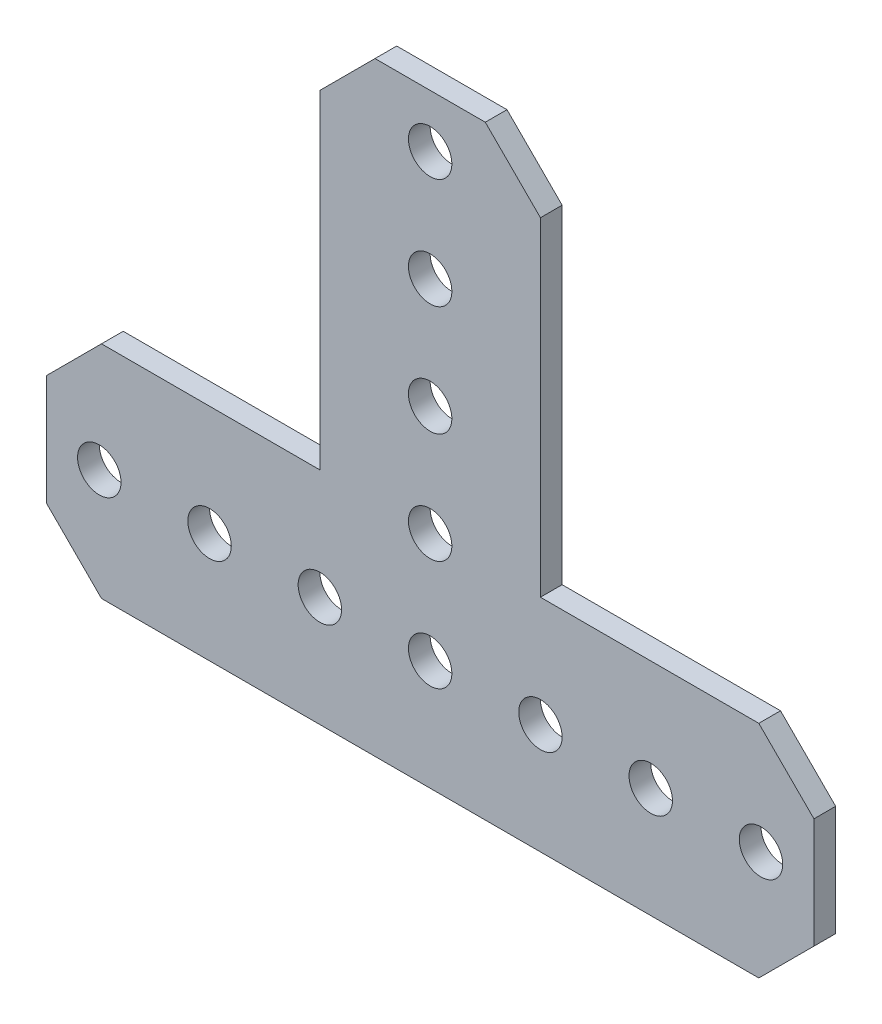
ISO-10303-21;
HEADER;
FILE_DESCRIPTION(('STEP AP214'),'2;1');
FILE_NAME('part.step','',(''),(''),'','','');
FILE_SCHEMA(('AUTOMOTIVE_DESIGN { 1 0 10303 214 1 1 1 1 }'));
ENDSEC;
DATA;
#1=APPLICATION_CONTEXT('core data for automotive mechanical design processes');
#2=APPLICATION_PROTOCOL_DEFINITION('international standard','automotive_design',2000,#1);
#3=PRODUCT_CONTEXT('',#1,'mechanical');
#4=PRODUCT('Part','Part','',(#3));
#5=PRODUCT_RELATED_PRODUCT_CATEGORY('part','',(#4));
#6=PRODUCT_DEFINITION_FORMATION('','',#4);
#7=PRODUCT_DEFINITION_CONTEXT('part definition',#1,'design');
#8=PRODUCT_DEFINITION('design','',#6,#7);
#9=PRODUCT_DEFINITION_SHAPE('','',#8);
#10=(LENGTH_UNIT() NAMED_UNIT(*) SI_UNIT(.MILLI.,.METRE.));
#11=(NAMED_UNIT(*) PLANE_ANGLE_UNIT() SI_UNIT($,.RADIAN.));
#12=(NAMED_UNIT(*) SI_UNIT($,.STERADIAN.) SOLID_ANGLE_UNIT());
#13=UNCERTAINTY_MEASURE_WITH_UNIT(LENGTH_MEASURE(1.E-05),#10,'distance_accuracy_value','');
#14=(GEOMETRIC_REPRESENTATION_CONTEXT(3) GLOBAL_UNCERTAINTY_ASSIGNED_CONTEXT((#13)) GLOBAL_UNIT_ASSIGNED_CONTEXT((#10,
#11,#12)) REPRESENTATION_CONTEXT('',''));
#15=CARTESIAN_POINT('',(0.,0.,0.));
#16=DIRECTION('',(0.,0.,1.));
#17=DIRECTION('',(1.,0.,0.));
#18=AXIS2_PLACEMENT_3D('',#15,#16,#17);
#19=CARTESIAN_POINT('',(-37.846,12.7,1.25));
#20=DIRECTION('',(0.,1.,0.));
#21=DIRECTION('',(0.,0.,1.));
#22=AXIS2_PLACEMENT_3D('',#19,#20,#21);
#23=PLANE('',#22);
#24=DIRECTION('',(1.,0.,0.));
#25=VECTOR('',#24,1.);
#26=CARTESIAN_POINT('',(-37.846,12.7,-1.25));
#27=LINE('',#26,#25);
#28=CARTESIAN_POINT('',(-37.846,12.7,-1.25));
#29=VERTEX_POINT('',#28);
#30=CARTESIAN_POINT('',(-12.7,12.7,-1.25));
#31=VERTEX_POINT('',#30);
#32=EDGE_CURVE('E172',#29,#31,#27,.T.);
#33=ORIENTED_EDGE('',*,*,#32,.F.);
#34=DIRECTION('',(0.,0.,-1.));
#35=VECTOR('',#34,1.);
#36=CARTESIAN_POINT('',(-37.846,12.7,1.25));
#37=LINE('',#36,#35);
#38=CARTESIAN_POINT('',(-37.846,12.7,1.25));
#39=VERTEX_POINT('',#38);
#40=EDGE_CURVE('E11',#39,#29,#37,.T.);
#41=ORIENTED_EDGE('',*,*,#40,.F.);
#42=DIRECTION('',(1.,0.,0.));
#43=VECTOR('',#42,1.);
#44=CARTESIAN_POINT('',(-37.846,12.7,1.25));
#45=LINE('',#44,#43);
#46=CARTESIAN_POINT('',(-12.7,12.7,1.25));
#47=VERTEX_POINT('',#46);
#48=EDGE_CURVE('E211',#39,#47,#45,.T.);
#49=ORIENTED_EDGE('',*,*,#48,.T.);
#50=DIRECTION('',(0.,0.,-1.));
#51=VECTOR('',#50,1.);
#52=CARTESIAN_POINT('',(-12.7,12.7,1.25));
#53=LINE('',#52,#51);
#54=EDGE_CURVE('E42',#47,#31,#53,.T.);
#55=ORIENTED_EDGE('',*,*,#54,.T.);
#56=EDGE_LOOP('',(#33,#41,#49,#55));
#57=FACE_BOUND('',#56,.T.);
#58=ADVANCED_FACE('F39',(#57),#23,.T.);
#59=CARTESIAN_POINT('',(-44.196,6.35,1.25));
#60=DIRECTION('',(-0.707106781186547,0.707106781186548,0.));
#61=DIRECTION('',(-0.707106781186548,-0.707106781186547,0.));
#62=AXIS2_PLACEMENT_3D('',#59,#60,#61);
#63=PLANE('',#62);
#64=DIRECTION('',(0.707106781186548,0.707106781186547,0.));
#65=VECTOR('',#64,1.);
#66=CARTESIAN_POINT('',(-44.196,6.35,-1.25));
#67=LINE('',#66,#65);
#68=CARTESIAN_POINT('',(-44.196,6.35,-1.25));
#69=VERTEX_POINT('',#68);
#70=EDGE_CURVE('E209',#69,#29,#67,.T.);
#71=ORIENTED_EDGE('',*,*,#70,.F.);
#72=DIRECTION('',(0.,0.,-1.));
#73=VECTOR('',#72,1.);
#74=CARTESIAN_POINT('',(-44.196,6.35,1.25));
#75=LINE('',#74,#73);
#76=CARTESIAN_POINT('',(-44.196,6.35,1.25));
#77=VERTEX_POINT('',#76);
#78=EDGE_CURVE('E48',#77,#69,#75,.T.);
#79=ORIENTED_EDGE('',*,*,#78,.F.);
#80=DIRECTION('',(0.707106781186548,0.707106781186547,0.));
#81=VECTOR('',#80,1.);
#82=CARTESIAN_POINT('',(-44.196,6.35,1.25));
#83=LINE('',#82,#81);
#84=EDGE_CURVE('E162',#77,#39,#83,.T.);
#85=ORIENTED_EDGE('',*,*,#84,.T.);
#86=ORIENTED_EDGE('',*,*,#40,.T.);
#87=EDGE_LOOP('',(#71,#79,#85,#86));
#88=FACE_BOUND('',#87,.T.);
#89=ADVANCED_FACE('F235',(#88),#63,.T.);
#90=CARTESIAN_POINT('',(-44.196,-6.35,1.25));
#91=DIRECTION('',(-1.,0.,0.));
#92=DIRECTION('',(0.,0.,1.));
#93=AXIS2_PLACEMENT_3D('',#90,#91,#92);
#94=PLANE('',#93);
#95=DIRECTION('',(0.,1.,0.));
#96=VECTOR('',#95,1.);
#97=CARTESIAN_POINT('',(-44.196,-6.35,-1.25));
#98=LINE('',#97,#96);
#99=CARTESIAN_POINT('',(-44.196,-6.35,-1.25));
#100=VERTEX_POINT('',#99);
#101=EDGE_CURVE('E149',#100,#69,#98,.T.);
#102=ORIENTED_EDGE('',*,*,#101,.F.);
#103=DIRECTION('',(0.,0.,-1.));
#104=VECTOR('',#103,1.);
#105=CARTESIAN_POINT('',(-44.196,-6.35,1.25));
#106=LINE('',#105,#104);
#107=CARTESIAN_POINT('',(-44.196,-6.35,1.25));
#108=VERTEX_POINT('',#107);
#109=EDGE_CURVE('E144',#108,#100,#106,.T.);
#110=ORIENTED_EDGE('',*,*,#109,.F.);
#111=DIRECTION('',(0.,1.,0.));
#112=VECTOR('',#111,1.);
#113=CARTESIAN_POINT('',(-44.196,-6.35,1.25));
#114=LINE('',#113,#112);
#115=EDGE_CURVE('E147',#108,#77,#114,.T.);
#116=ORIENTED_EDGE('',*,*,#115,.T.);
#117=ORIENTED_EDGE('',*,*,#78,.T.);
#118=EDGE_LOOP('',(#102,#110,#116,#117));
#119=FACE_BOUND('',#118,.T.);
#120=ADVANCED_FACE('F146',(#119),#94,.T.);
#121=CARTESIAN_POINT('',(-37.846,-12.7,1.25));
#122=DIRECTION('',(-0.707106781186547,-0.707106781186548,0.));
#123=DIRECTION('',(0.707106781186548,-0.707106781186547,0.));
#124=AXIS2_PLACEMENT_3D('',#121,#122,#123);
#125=PLANE('',#124);
#126=DIRECTION('',(-0.707106781186548,0.707106781186547,0.));
#127=VECTOR('',#126,1.);
#128=CARTESIAN_POINT('',(-37.846,-12.7,-1.25));
#129=LINE('',#128,#127);
#130=CARTESIAN_POINT('',(-37.846,-12.7,-1.25));
#131=VERTEX_POINT('',#130);
#132=EDGE_CURVE('E206',#131,#100,#129,.T.);
#133=ORIENTED_EDGE('',*,*,#132,.F.);
#134=DIRECTION('',(0.,0.,-1.));
#135=VECTOR('',#134,1.);
#136=CARTESIAN_POINT('',(-37.846,-12.7,1.25));
#137=LINE('',#136,#135);
#138=CARTESIAN_POINT('',(-37.846,-12.7,1.25));
#139=VERTEX_POINT('',#138);
#140=EDGE_CURVE('E154',#139,#131,#137,.T.);
#141=ORIENTED_EDGE('',*,*,#140,.F.);
#142=DIRECTION('',(-0.707106781186548,0.707106781186547,0.));
#143=VECTOR('',#142,1.);
#144=CARTESIAN_POINT('',(-37.846,-12.7,1.25));
#145=LINE('',#144,#143);
#146=EDGE_CURVE('E160',#139,#108,#145,.T.);
#147=ORIENTED_EDGE('',*,*,#146,.T.);
#148=ORIENTED_EDGE('',*,*,#109,.T.);
#149=EDGE_LOOP('',(#133,#141,#147,#148));
#150=FACE_BOUND('',#149,.T.);
#151=ADVANCED_FACE('F164',(#150),#125,.T.);
#152=CARTESIAN_POINT('',(37.846,-12.7,1.25));
#153=DIRECTION('',(0.,-1.,0.));
#154=DIRECTION('',(0.,0.,-1.));
#155=AXIS2_PLACEMENT_3D('',#152,#153,#154);
#156=PLANE('',#155);
#157=DIRECTION('',(-1.,0.,0.));
#158=VECTOR('',#157,1.);
#159=CARTESIAN_POINT('',(37.846,-12.7,-1.25));
#160=LINE('',#159,#158);
#161=CARTESIAN_POINT('',(37.846,-12.7,-1.25));
#162=VERTEX_POINT('',#161);
#163=EDGE_CURVE('E203',#162,#131,#160,.T.);
#164=ORIENTED_EDGE('',*,*,#163,.F.);
#165=DIRECTION('',(0.,0.,-1.));
#166=VECTOR('',#165,1.);
#167=CARTESIAN_POINT('',(37.846,-12.7,1.25));
#168=LINE('',#167,#166);
#169=CARTESIAN_POINT('',(37.846,-12.7,1.25));
#170=VERTEX_POINT('',#169);
#171=EDGE_CURVE('E215',#170,#162,#168,.T.);
#172=ORIENTED_EDGE('',*,*,#171,.F.);
#173=DIRECTION('',(-1.,0.,0.));
#174=VECTOR('',#173,1.);
#175=CARTESIAN_POINT('',(37.846,-12.7,1.25));
#176=LINE('',#175,#174);
#177=EDGE_CURVE('E165',#170,#139,#176,.T.);
#178=ORIENTED_EDGE('',*,*,#177,.T.);
#179=ORIENTED_EDGE('',*,*,#140,.T.);
#180=EDGE_LOOP('',(#164,#172,#178,#179));
#181=FACE_BOUND('',#180,.T.);
#182=ADVANCED_FACE('F248',(#181),#156,.T.);
#183=CARTESIAN_POINT('',(44.196,-6.35,1.25));
#184=DIRECTION('',(0.707106781186547,-0.707106781186548,0.));
#185=DIRECTION('',(0.707106781186548,0.707106781186547,0.));
#186=AXIS2_PLACEMENT_3D('',#183,#184,#185);
#187=PLANE('',#186);
#188=DIRECTION('',(-0.707106781186548,-0.707106781186547,0.));
#189=VECTOR('',#188,1.);
#190=CARTESIAN_POINT('',(44.196,-6.35,-1.25));
#191=LINE('',#190,#189);
#192=CARTESIAN_POINT('',(44.196,-6.35,-1.25));
#193=VERTEX_POINT('',#192);
#194=EDGE_CURVE('E200',#193,#162,#191,.T.);
#195=ORIENTED_EDGE('',*,*,#194,.F.);
#196=DIRECTION('',(0.,0.,-1.));
#197=VECTOR('',#196,1.);
#198=CARTESIAN_POINT('',(44.196,-6.35,1.25));
#199=LINE('',#198,#197);
#200=CARTESIAN_POINT('',(44.196,-6.35,1.25));
#201=VERTEX_POINT('',#200);
#202=EDGE_CURVE('E217',#201,#193,#199,.T.);
#203=ORIENTED_EDGE('',*,*,#202,.F.);
#204=DIRECTION('',(-0.707106781186548,-0.707106781186547,0.));
#205=VECTOR('',#204,1.);
#206=CARTESIAN_POINT('',(44.196,-6.35,1.25));
#207=LINE('',#206,#205);
#208=EDGE_CURVE('E167',#201,#170,#207,.T.);
#209=ORIENTED_EDGE('',*,*,#208,.T.);
#210=ORIENTED_EDGE('',*,*,#171,.T.);
#211=EDGE_LOOP('',(#195,#203,#209,#210));
#212=FACE_BOUND('',#211,.T.);
#213=ADVANCED_FACE('F251',(#212),#187,.T.);
#214=CARTESIAN_POINT('',(44.196,6.35,1.25));
#215=DIRECTION('',(1.,0.,0.));
#216=DIRECTION('',(0.,0.,-1.));
#217=AXIS2_PLACEMENT_3D('',#214,#215,#216);
#218=PLANE('',#217);
#219=DIRECTION('',(0.,-1.,0.));
#220=VECTOR('',#219,1.);
#221=CARTESIAN_POINT('',(44.196,6.35,-1.25));
#222=LINE('',#221,#220);
#223=CARTESIAN_POINT('',(44.196,6.35,-1.25));
#224=VERTEX_POINT('',#223);
#225=EDGE_CURVE('E197',#224,#193,#222,.T.);
#226=ORIENTED_EDGE('',*,*,#225,.F.);
#227=DIRECTION('',(0.,0.,-1.));
#228=VECTOR('',#227,1.);
#229=CARTESIAN_POINT('',(44.196,6.35,1.25));
#230=LINE('',#229,#228);
#231=CARTESIAN_POINT('',(44.196,6.35,1.25));
#232=VERTEX_POINT('',#231);
#233=EDGE_CURVE('E219',#232,#224,#230,.T.);
#234=ORIENTED_EDGE('',*,*,#233,.F.);
#235=DIRECTION('',(0.,-1.,0.));
#236=VECTOR('',#235,1.);
#237=CARTESIAN_POINT('',(44.196,6.35,1.25));
#238=LINE('',#237,#236);
#239=EDGE_CURVE('E429',#232,#201,#238,.T.);
#240=ORIENTED_EDGE('',*,*,#239,.T.);
#241=ORIENTED_EDGE('',*,*,#202,.T.);
#242=EDGE_LOOP('',(#226,#234,#240,#241));
#243=FACE_BOUND('',#242,.T.);
#244=ADVANCED_FACE('F255',(#243),#218,.T.);
#245=CARTESIAN_POINT('',(37.846,12.7,1.25));
#246=DIRECTION('',(0.707106781186547,0.707106781186548,0.));
#247=DIRECTION('',(-0.707106781186548,0.707106781186547,0.));
#248=AXIS2_PLACEMENT_3D('',#245,#246,#247);
#249=PLANE('',#248);
#250=DIRECTION('',(0.707106781186548,-0.707106781186547,0.));
#251=VECTOR('',#250,1.);
#252=CARTESIAN_POINT('',(37.846,12.7,-1.25));
#253=LINE('',#252,#251);
#254=CARTESIAN_POINT('',(37.846,12.7,-1.25));
#255=VERTEX_POINT('',#254);
#256=EDGE_CURVE('E194',#255,#224,#253,.T.);
#257=ORIENTED_EDGE('',*,*,#256,.F.);
#258=DIRECTION('',(0.,0.,-1.));
#259=VECTOR('',#258,1.);
#260=CARTESIAN_POINT('',(37.846,12.7,1.25));
#261=LINE('',#260,#259);
#262=CARTESIAN_POINT('',(37.846,12.7,1.25));
#263=VERTEX_POINT('',#262);
#264=EDGE_CURVE('E221',#263,#255,#261,.T.);
#265=ORIENTED_EDGE('',*,*,#264,.F.);
#266=DIRECTION('',(0.707106781186548,-0.707106781186547,0.));
#267=VECTOR('',#266,1.);
#268=CARTESIAN_POINT('',(37.846,12.7,1.25));
#269=LINE('',#268,#267);
#270=EDGE_CURVE('E426',#263,#232,#269,.T.);
#271=ORIENTED_EDGE('',*,*,#270,.T.);
#272=ORIENTED_EDGE('',*,*,#233,.T.);
#273=EDGE_LOOP('',(#257,#265,#271,#272));
#274=FACE_BOUND('',#273,.T.);
#275=ADVANCED_FACE('F259',(#274),#249,.T.);
#276=CARTESIAN_POINT('',(12.7,12.7,1.25));
#277=DIRECTION('',(0.,1.,0.));
#278=DIRECTION('',(0.,0.,1.));
#279=AXIS2_PLACEMENT_3D('',#276,#277,#278);
#280=PLANE('',#279);
#281=DIRECTION('',(1.,0.,0.));
#282=VECTOR('',#281,1.);
#283=CARTESIAN_POINT('',(12.7,12.7,-1.25));
#284=LINE('',#283,#282);
#285=CARTESIAN_POINT('',(12.7,12.7,-1.25));
#286=VERTEX_POINT('',#285);
#287=EDGE_CURVE('E191',#286,#255,#284,.T.);
#288=ORIENTED_EDGE('',*,*,#287,.F.);
#289=DIRECTION('',(0.,0.,-1.));
#290=VECTOR('',#289,1.);
#291=CARTESIAN_POINT('',(12.7,12.7,1.25));
#292=LINE('',#291,#290);
#293=CARTESIAN_POINT('',(12.7,12.7,1.25));
#294=VERTEX_POINT('',#293);
#295=EDGE_CURVE('E223',#294,#286,#292,.T.);
#296=ORIENTED_EDGE('',*,*,#295,.F.);
#297=DIRECTION('',(1.,0.,0.));
#298=VECTOR('',#297,1.);
#299=CARTESIAN_POINT('',(12.7,12.7,1.25));
#300=LINE('',#299,#298);
#301=EDGE_CURVE('E423',#294,#263,#300,.T.);
#302=ORIENTED_EDGE('',*,*,#301,.T.);
#303=ORIENTED_EDGE('',*,*,#264,.T.);
#304=EDGE_LOOP('',(#288,#296,#302,#303));
#305=FACE_BOUND('',#304,.T.);
#306=ADVANCED_FACE('F263',(#305),#280,.T.);
#307=CARTESIAN_POINT('',(12.7,50.546,1.25));
#308=DIRECTION('',(1.,0.,0.));
#309=DIRECTION('',(0.,0.,-1.));
#310=AXIS2_PLACEMENT_3D('',#307,#308,#309);
#311=PLANE('',#310);
#312=DIRECTION('',(0.,-1.,0.));
#313=VECTOR('',#312,1.);
#314=CARTESIAN_POINT('',(12.7,50.546,-1.25));
#315=LINE('',#314,#313);
#316=CARTESIAN_POINT('',(12.7,50.546,-1.25));
#317=VERTEX_POINT('',#316);
#318=EDGE_CURVE('E188',#317,#286,#315,.T.);
#319=ORIENTED_EDGE('',*,*,#318,.F.);
#320=DIRECTION('',(0.,0.,-1.));
#321=VECTOR('',#320,1.);
#322=CARTESIAN_POINT('',(12.7,50.546,1.25));
#323=LINE('',#322,#321);
#324=CARTESIAN_POINT('',(12.7,50.546,1.25));
#325=VERTEX_POINT('',#324);
#326=EDGE_CURVE('E225',#325,#317,#323,.T.);
#327=ORIENTED_EDGE('',*,*,#326,.F.);
#328=DIRECTION('',(0.,-1.,0.));
#329=VECTOR('',#328,1.);
#330=CARTESIAN_POINT('',(12.7,50.546,1.25));
#331=LINE('',#330,#329);
#332=EDGE_CURVE('E420',#325,#294,#331,.T.);
#333=ORIENTED_EDGE('',*,*,#332,.T.);
#334=ORIENTED_EDGE('',*,*,#295,.T.);
#335=EDGE_LOOP('',(#319,#327,#333,#334));
#336=FACE_BOUND('',#335,.T.);
#337=ADVANCED_FACE('F267',(#336),#311,.T.);
#338=CARTESIAN_POINT('',(6.35,56.896,1.25));
#339=DIRECTION('',(0.707106781186548,0.707106781186547,0.));
#340=DIRECTION('',(-0.707106781186547,0.707106781186548,0.));
#341=AXIS2_PLACEMENT_3D('',#338,#339,#340);
#342=PLANE('',#341);
#343=DIRECTION('',(0.707106781186547,-0.707106781186548,0.));
#344=VECTOR('',#343,1.);
#345=CARTESIAN_POINT('',(6.35,56.896,-1.25));
#346=LINE('',#345,#344);
#347=CARTESIAN_POINT('',(6.35,56.896,-1.25));
#348=VERTEX_POINT('',#347);
#349=EDGE_CURVE('E185',#348,#317,#346,.T.);
#350=ORIENTED_EDGE('',*,*,#349,.F.);
#351=DIRECTION('',(0.,0.,-1.));
#352=VECTOR('',#351,1.);
#353=CARTESIAN_POINT('',(6.35,56.896,1.25));
#354=LINE('',#353,#352);
#355=CARTESIAN_POINT('',(6.35,56.896,1.25));
#356=VERTEX_POINT('',#355);
#357=EDGE_CURVE('E227',#356,#348,#354,.T.);
#358=ORIENTED_EDGE('',*,*,#357,.F.);
#359=DIRECTION('',(0.707106781186547,-0.707106781186548,0.));
#360=VECTOR('',#359,1.);
#361=CARTESIAN_POINT('',(6.35,56.896,1.25));
#362=LINE('',#361,#360);
#363=EDGE_CURVE('E417',#356,#325,#362,.T.);
#364=ORIENTED_EDGE('',*,*,#363,.T.);
#365=ORIENTED_EDGE('',*,*,#326,.T.);
#366=EDGE_LOOP('',(#350,#358,#364,#365));
#367=FACE_BOUND('',#366,.T.);
#368=ADVANCED_FACE('F271',(#367),#342,.T.);
#369=CARTESIAN_POINT('',(-6.35,56.896,1.25));
#370=DIRECTION('',(0.,1.,0.));
#371=DIRECTION('',(0.,0.,1.));
#372=AXIS2_PLACEMENT_3D('',#369,#370,#371);
#373=PLANE('',#372);
#374=DIRECTION('',(1.,0.,0.));
#375=VECTOR('',#374,1.);
#376=CARTESIAN_POINT('',(-6.35,56.896,-1.25));
#377=LINE('',#376,#375);
#378=CARTESIAN_POINT('',(-6.35,56.896,-1.25));
#379=VERTEX_POINT('',#378);
#380=EDGE_CURVE('E182',#379,#348,#377,.T.);
#381=ORIENTED_EDGE('',*,*,#380,.F.);
#382=DIRECTION('',(0.,0.,-1.));
#383=VECTOR('',#382,1.);
#384=CARTESIAN_POINT('',(-6.35,56.896,1.25));
#385=LINE('',#384,#383);
#386=CARTESIAN_POINT('',(-6.35,56.896,1.25));
#387=VERTEX_POINT('',#386);
#388=EDGE_CURVE('E229',#387,#379,#385,.T.);
#389=ORIENTED_EDGE('',*,*,#388,.F.);
#390=DIRECTION('',(1.,0.,0.));
#391=VECTOR('',#390,1.);
#392=CARTESIAN_POINT('',(-6.35,56.896,1.25));
#393=LINE('',#392,#391);
#394=EDGE_CURVE('E414',#387,#356,#393,.T.);
#395=ORIENTED_EDGE('',*,*,#394,.T.);
#396=ORIENTED_EDGE('',*,*,#357,.T.);
#397=EDGE_LOOP('',(#381,#389,#395,#396));
#398=FACE_BOUND('',#397,.T.);
#399=ADVANCED_FACE('F275',(#398),#373,.T.);
#400=CARTESIAN_POINT('',(-12.7,50.546,1.25));
#401=DIRECTION('',(-0.707106781186548,0.707106781186547,0.));
#402=DIRECTION('',(-0.707106781186547,-0.707106781186548,0.));
#403=AXIS2_PLACEMENT_3D('',#400,#401,#402);
#404=PLANE('',#403);
#405=DIRECTION('',(0.707106781186547,0.707106781186548,0.));
#406=VECTOR('',#405,1.);
#407=CARTESIAN_POINT('',(-12.7,50.546,-1.25));
#408=LINE('',#407,#406);
#409=CARTESIAN_POINT('',(-12.7,50.546,-1.25));
#410=VERTEX_POINT('',#409);
#411=EDGE_CURVE('E179',#410,#379,#408,.T.);
#412=ORIENTED_EDGE('',*,*,#411,.F.);
#413=DIRECTION('',(0.,0.,-1.));
#414=VECTOR('',#413,1.);
#415=CARTESIAN_POINT('',(-12.7,50.546,1.25));
#416=LINE('',#415,#414);
#417=CARTESIAN_POINT('',(-12.7,50.546,1.25));
#418=VERTEX_POINT('',#417);
#419=EDGE_CURVE('E230',#418,#410,#416,.T.);
#420=ORIENTED_EDGE('',*,*,#419,.F.);
#421=DIRECTION('',(0.707106781186547,0.707106781186548,0.));
#422=VECTOR('',#421,1.);
#423=CARTESIAN_POINT('',(-12.7,50.546,1.25));
#424=LINE('',#423,#422);
#425=EDGE_CURVE('E411',#418,#387,#424,.T.);
#426=ORIENTED_EDGE('',*,*,#425,.T.);
#427=ORIENTED_EDGE('',*,*,#388,.T.);
#428=EDGE_LOOP('',(#412,#420,#426,#427));
#429=FACE_BOUND('',#428,.T.);
#430=ADVANCED_FACE('F279',(#429),#404,.T.);
#431=CARTESIAN_POINT('',(-12.7,12.7,1.25));
#432=DIRECTION('',(-1.,0.,0.));
#433=DIRECTION('',(0.,0.,1.));
#434=AXIS2_PLACEMENT_3D('',#431,#432,#433);
#435=PLANE('',#434);
#436=DIRECTION('',(0.,1.,0.));
#437=VECTOR('',#436,1.);
#438=CARTESIAN_POINT('',(-12.7,12.7,-1.25));
#439=LINE('',#438,#437);
#440=EDGE_CURVE('E175',#31,#410,#439,.T.);
#441=ORIENTED_EDGE('',*,*,#440,.F.);
#442=ORIENTED_EDGE('',*,*,#54,.F.);
#443=DIRECTION('',(0.,1.,0.));
#444=VECTOR('',#443,1.);
#445=CARTESIAN_POINT('',(-12.7,12.7,1.25));
#446=LINE('',#445,#444);
#447=EDGE_CURVE('E409',#47,#418,#446,.T.);
#448=ORIENTED_EDGE('',*,*,#447,.T.);
#449=ORIENTED_EDGE('',*,*,#419,.T.);
#450=EDGE_LOOP('',(#441,#442,#448,#449));
#451=FACE_BOUND('',#450,.T.);
#452=ADVANCED_FACE('F232',(#451),#435,.T.);
#453=CARTESIAN_POINT('',(0.,0.,1.25));
#454=DIRECTION('',(0.,0.,1.));
#455=DIRECTION('',(1.,0.,0.));
#456=AXIS2_PLACEMENT_3D('',#453,#454,#455);
#457=PLANE('',#456);
#458=CARTESIAN_POINT('',(0.,25.4,1.25));
#459=DIRECTION('',(0.,0.,-1.));
#460=DIRECTION('',(1.,0.,0.));
#461=AXIS2_PLACEMENT_3D('',#458,#459,#460);
#462=CIRCLE('',#461,2.5);
#463=CARTESIAN_POINT('',(2.5,25.4,1.25));
#464=VERTEX_POINT('',#463);
#465=EDGE_CURVE('E342',#464,#464,#462,.T.);
#466=ORIENTED_EDGE('',*,*,#465,.T.);
#467=EDGE_LOOP('',(#466));
#468=FACE_BOUND('',#467,.T.);
#469=CARTESIAN_POINT('',(0.,12.7,1.25));
#470=DIRECTION('',(0.,0.,-1.));
#471=DIRECTION('',(1.,0.,0.));
#472=AXIS2_PLACEMENT_3D('',#469,#470,#471);
#473=CIRCLE('',#472,2.5);
#474=CARTESIAN_POINT('',(2.5,12.7,1.25));
#475=VERTEX_POINT('',#474);
#476=EDGE_CURVE('E350',#475,#475,#473,.T.);
#477=ORIENTED_EDGE('',*,*,#476,.T.);
#478=EDGE_LOOP('',(#477));
#479=FACE_BOUND('',#478,.T.);
#480=CARTESIAN_POINT('',(-25.4,0.,1.25));
#481=DIRECTION('',(0.,0.,-1.));
#482=DIRECTION('',(1.,0.,0.));
#483=AXIS2_PLACEMENT_3D('',#480,#481,#482);
#484=CIRCLE('',#483,2.5);
#485=CARTESIAN_POINT('',(-22.9,0.,1.25));
#486=VERTEX_POINT('',#485);
#487=EDGE_CURVE('E356',#486,#486,#484,.T.);
#488=ORIENTED_EDGE('',*,*,#487,.T.);
#489=EDGE_LOOP('',(#488));
#490=FACE_BOUND('',#489,.T.);
#491=CARTESIAN_POINT('',(-38.1,0.,1.25));
#492=DIRECTION('',(0.,0.,-1.));
#493=DIRECTION('',(1.,0.,0.));
#494=AXIS2_PLACEMENT_3D('',#491,#492,#493);
#495=CIRCLE('',#494,2.5);
#496=CARTESIAN_POINT('',(-35.6,0.,1.25));
#497=VERTEX_POINT('',#496);
#498=EDGE_CURVE('E362',#497,#497,#495,.T.);
#499=ORIENTED_EDGE('',*,*,#498,.T.);
#500=EDGE_LOOP('',(#499));
#501=FACE_BOUND('',#500,.T.);
#502=CARTESIAN_POINT('',(-12.7,0.,1.25));
#503=DIRECTION('',(0.,0.,-1.));
#504=DIRECTION('',(1.,0.,0.));
#505=AXIS2_PLACEMENT_3D('',#502,#503,#504);
#506=CIRCLE('',#505,2.5);
#507=CARTESIAN_POINT('',(-10.2,0.,1.25));
#508=VERTEX_POINT('',#507);
#509=EDGE_CURVE('E368',#508,#508,#506,.T.);
#510=ORIENTED_EDGE('',*,*,#509,.T.);
#511=EDGE_LOOP('',(#510));
#512=FACE_BOUND('',#511,.T.);
#513=CARTESIAN_POINT('',(0.,0.,1.25));
#514=DIRECTION('',(0.,0.,-1.));
#515=DIRECTION('',(1.,0.,0.));
#516=AXIS2_PLACEMENT_3D('',#513,#514,#515);
#517=CIRCLE('',#516,2.5);
#518=CARTESIAN_POINT('',(2.49999999999999,0.,1.25));
#519=VERTEX_POINT('',#518);
#520=EDGE_CURVE('E374',#519,#519,#517,.T.);
#521=ORIENTED_EDGE('',*,*,#520,.T.);
#522=EDGE_LOOP('',(#521));
#523=FACE_BOUND('',#522,.T.);
#524=CARTESIAN_POINT('',(12.7,0.,1.25));
#525=DIRECTION('',(0.,0.,-1.));
#526=DIRECTION('',(1.,0.,0.));
#527=AXIS2_PLACEMENT_3D('',#524,#525,#526);
#528=CIRCLE('',#527,2.5);
#529=CARTESIAN_POINT('',(15.2,0.,1.25));
#530=VERTEX_POINT('',#529);
#531=EDGE_CURVE('E380',#530,#530,#528,.T.);
#532=ORIENTED_EDGE('',*,*,#531,.T.);
#533=EDGE_LOOP('',(#532));
#534=FACE_BOUND('',#533,.T.);
#535=CARTESIAN_POINT('',(25.4,0.,1.25));
#536=DIRECTION('',(0.,0.,-1.));
#537=DIRECTION('',(1.,0.,0.));
#538=AXIS2_PLACEMENT_3D('',#535,#536,#537);
#539=CIRCLE('',#538,2.5);
#540=CARTESIAN_POINT('',(27.9,0.,1.25));
#541=VERTEX_POINT('',#540);
#542=EDGE_CURVE('E386',#541,#541,#539,.T.);
#543=ORIENTED_EDGE('',*,*,#542,.T.);
#544=EDGE_LOOP('',(#543));
#545=FACE_BOUND('',#544,.T.);
#546=CARTESIAN_POINT('',(38.1,0.,1.25));
#547=DIRECTION('',(0.,0.,-1.));
#548=DIRECTION('',(1.,0.,0.));
#549=AXIS2_PLACEMENT_3D('',#546,#547,#548);
#550=CIRCLE('',#549,2.5);
#551=CARTESIAN_POINT('',(40.6,0.,1.25));
#552=VERTEX_POINT('',#551);
#553=EDGE_CURVE('E392',#552,#552,#550,.T.);
#554=ORIENTED_EDGE('',*,*,#553,.T.);
#555=EDGE_LOOP('',(#554));
#556=FACE_BOUND('',#555,.T.);
#557=CARTESIAN_POINT('',(0.,38.1,1.25));
#558=DIRECTION('',(0.,0.,-1.));
#559=DIRECTION('',(1.,0.,0.));
#560=AXIS2_PLACEMENT_3D('',#557,#558,#559);
#561=CIRCLE('',#560,2.5);
#562=CARTESIAN_POINT('',(2.5,38.1,1.25));
#563=VERTEX_POINT('',#562);
#564=EDGE_CURVE('E398',#563,#563,#561,.T.);
#565=ORIENTED_EDGE('',*,*,#564,.T.);
#566=EDGE_LOOP('',(#565));
#567=FACE_BOUND('',#566,.T.);
#568=CARTESIAN_POINT('',(0.,50.8,1.25));
#569=DIRECTION('',(0.,0.,-1.));
#570=DIRECTION('',(1.,0.,0.));
#571=AXIS2_PLACEMENT_3D('',#568,#569,#570);
#572=CIRCLE('',#571,2.5);
#573=CARTESIAN_POINT('',(2.5,50.8,1.25));
#574=VERTEX_POINT('',#573);
#575=EDGE_CURVE('E176',#574,#574,#572,.T.);
#576=ORIENTED_EDGE('',*,*,#575,.T.);
#577=EDGE_LOOP('',(#576));
#578=FACE_BOUND('',#577,.T.);
#579=ORIENTED_EDGE('',*,*,#48,.F.);
#580=ORIENTED_EDGE('',*,*,#84,.F.);
#581=ORIENTED_EDGE('',*,*,#115,.F.);
#582=ORIENTED_EDGE('',*,*,#146,.F.);
#583=ORIENTED_EDGE('',*,*,#177,.F.);
#584=ORIENTED_EDGE('',*,*,#208,.F.);
#585=ORIENTED_EDGE('',*,*,#239,.F.);
#586=ORIENTED_EDGE('',*,*,#270,.F.);
#587=ORIENTED_EDGE('',*,*,#301,.F.);
#588=ORIENTED_EDGE('',*,*,#332,.F.);
#589=ORIENTED_EDGE('',*,*,#363,.F.);
#590=ORIENTED_EDGE('',*,*,#394,.F.);
#591=ORIENTED_EDGE('',*,*,#425,.F.);
#592=ORIENTED_EDGE('',*,*,#447,.F.);
#593=EDGE_LOOP('',(#579,#580,#581,#582,#583,#584,#585,#586,#587,#588,#589,#590,#591,#592));
#594=FACE_BOUND('',#593,.T.);
#595=ADVANCED_FACE('F158',(#468,#479,#490,#501,#512,#523,#534,#545,#556,#567,#578,#594),#457,.T.);
#596=CARTESIAN_POINT('',(0.,0.,-1.25));
#597=DIRECTION('',(0.,0.,1.));
#598=DIRECTION('',(1.,0.,0.));
#599=AXIS2_PLACEMENT_3D('',#596,#597,#598);
#600=PLANE('',#599);
#601=CARTESIAN_POINT('',(0.,25.4,-1.25));
#602=DIRECTION('',(0.,0.,-1.));
#603=DIRECTION('',(1.,0.,0.));
#604=AXIS2_PLACEMENT_3D('',#601,#602,#603);
#605=CIRCLE('',#604,2.5);
#606=CARTESIAN_POINT('',(2.5,25.4,-1.25));
#607=VERTEX_POINT('',#606);
#608=EDGE_CURVE('E345',#607,#607,#605,.T.);
#609=ORIENTED_EDGE('',*,*,#608,.F.);
#610=EDGE_LOOP('',(#609));
#611=FACE_BOUND('',#610,.T.);
#612=CARTESIAN_POINT('',(0.,12.7,-1.25));
#613=DIRECTION('',(0.,0.,-1.));
#614=DIRECTION('',(1.,0.,0.));
#615=AXIS2_PLACEMENT_3D('',#612,#613,#614);
#616=CIRCLE('',#615,2.5);
#617=CARTESIAN_POINT('',(2.5,12.7,-1.25));
#618=VERTEX_POINT('',#617);
#619=EDGE_CURVE('E347',#618,#618,#616,.T.);
#620=ORIENTED_EDGE('',*,*,#619,.F.);
#621=EDGE_LOOP('',(#620));
#622=FACE_BOUND('',#621,.T.);
#623=CARTESIAN_POINT('',(-25.4,0.,-1.25));
#624=DIRECTION('',(0.,0.,-1.));
#625=DIRECTION('',(1.,0.,0.));
#626=AXIS2_PLACEMENT_3D('',#623,#624,#625);
#627=CIRCLE('',#626,2.5);
#628=CARTESIAN_POINT('',(-22.9,0.,-1.25));
#629=VERTEX_POINT('',#628);
#630=EDGE_CURVE('E353',#629,#629,#627,.T.);
#631=ORIENTED_EDGE('',*,*,#630,.F.);
#632=EDGE_LOOP('',(#631));
#633=FACE_BOUND('',#632,.T.);
#634=CARTESIAN_POINT('',(-38.1,0.,-1.25));
#635=DIRECTION('',(0.,0.,-1.));
#636=DIRECTION('',(1.,0.,0.));
#637=AXIS2_PLACEMENT_3D('',#634,#635,#636);
#638=CIRCLE('',#637,2.5);
#639=CARTESIAN_POINT('',(-35.6,0.,-1.25));
#640=VERTEX_POINT('',#639);
#641=EDGE_CURVE('E359',#640,#640,#638,.T.);
#642=ORIENTED_EDGE('',*,*,#641,.F.);
#643=EDGE_LOOP('',(#642));
#644=FACE_BOUND('',#643,.T.);
#645=CARTESIAN_POINT('',(-12.7,0.,-1.25));
#646=DIRECTION('',(0.,0.,-1.));
#647=DIRECTION('',(1.,0.,0.));
#648=AXIS2_PLACEMENT_3D('',#645,#646,#647);
#649=CIRCLE('',#648,2.5);
#650=CARTESIAN_POINT('',(-10.2,0.,-1.25));
#651=VERTEX_POINT('',#650);
#652=EDGE_CURVE('E365',#651,#651,#649,.T.);
#653=ORIENTED_EDGE('',*,*,#652,.F.);
#654=EDGE_LOOP('',(#653));
#655=FACE_BOUND('',#654,.T.);
#656=CARTESIAN_POINT('',(0.,0.,-1.25));
#657=DIRECTION('',(0.,0.,-1.));
#658=DIRECTION('',(1.,0.,0.));
#659=AXIS2_PLACEMENT_3D('',#656,#657,#658);
#660=CIRCLE('',#659,2.5);
#661=CARTESIAN_POINT('',(2.49999999999999,0.,-1.25));
#662=VERTEX_POINT('',#661);
#663=EDGE_CURVE('E371',#662,#662,#660,.T.);
#664=ORIENTED_EDGE('',*,*,#663,.F.);
#665=EDGE_LOOP('',(#664));
#666=FACE_BOUND('',#665,.T.);
#667=CARTESIAN_POINT('',(12.7,0.,-1.25));
#668=DIRECTION('',(0.,0.,-1.));
#669=DIRECTION('',(1.,0.,0.));
#670=AXIS2_PLACEMENT_3D('',#667,#668,#669);
#671=CIRCLE('',#670,2.5);
#672=CARTESIAN_POINT('',(15.2,0.,-1.25));
#673=VERTEX_POINT('',#672);
#674=EDGE_CURVE('E377',#673,#673,#671,.T.);
#675=ORIENTED_EDGE('',*,*,#674,.F.);
#676=EDGE_LOOP('',(#675));
#677=FACE_BOUND('',#676,.T.);
#678=CARTESIAN_POINT('',(25.4,0.,-1.25));
#679=DIRECTION('',(0.,0.,-1.));
#680=DIRECTION('',(1.,0.,0.));
#681=AXIS2_PLACEMENT_3D('',#678,#679,#680);
#682=CIRCLE('',#681,2.5);
#683=CARTESIAN_POINT('',(27.9,0.,-1.25));
#684=VERTEX_POINT('',#683);
#685=EDGE_CURVE('E383',#684,#684,#682,.T.);
#686=ORIENTED_EDGE('',*,*,#685,.F.);
#687=EDGE_LOOP('',(#686));
#688=FACE_BOUND('',#687,.T.);
#689=CARTESIAN_POINT('',(38.1,0.,-1.25));
#690=DIRECTION('',(0.,0.,-1.));
#691=DIRECTION('',(1.,0.,0.));
#692=AXIS2_PLACEMENT_3D('',#689,#690,#691);
#693=CIRCLE('',#692,2.5);
#694=CARTESIAN_POINT('',(40.6,0.,-1.25));
#695=VERTEX_POINT('',#694);
#696=EDGE_CURVE('E389',#695,#695,#693,.T.);
#697=ORIENTED_EDGE('',*,*,#696,.F.);
#698=EDGE_LOOP('',(#697));
#699=FACE_BOUND('',#698,.T.);
#700=CARTESIAN_POINT('',(0.,38.1,-1.25));
#701=DIRECTION('',(0.,0.,-1.));
#702=DIRECTION('',(1.,0.,0.));
#703=AXIS2_PLACEMENT_3D('',#700,#701,#702);
#704=CIRCLE('',#703,2.5);
#705=CARTESIAN_POINT('',(2.5,38.1,-1.25));
#706=VERTEX_POINT('',#705);
#707=EDGE_CURVE('E395',#706,#706,#704,.T.);
#708=ORIENTED_EDGE('',*,*,#707,.F.);
#709=EDGE_LOOP('',(#708));
#710=FACE_BOUND('',#709,.T.);
#711=CARTESIAN_POINT('',(0.,50.8,-1.25));
#712=DIRECTION('',(0.,0.,-1.));
#713=DIRECTION('',(1.,0.,0.));
#714=AXIS2_PLACEMENT_3D('',#711,#712,#713);
#715=CIRCLE('',#714,2.5);
#716=CARTESIAN_POINT('',(2.5,50.8,-1.25));
#717=VERTEX_POINT('',#716);
#718=EDGE_CURVE('E401',#717,#717,#715,.T.);
#719=ORIENTED_EDGE('',*,*,#718,.F.);
#720=EDGE_LOOP('',(#719));
#721=FACE_BOUND('',#720,.T.);
#722=ORIENTED_EDGE('',*,*,#32,.T.);
#723=ORIENTED_EDGE('',*,*,#440,.T.);
#724=ORIENTED_EDGE('',*,*,#411,.T.);
#725=ORIENTED_EDGE('',*,*,#380,.T.);
#726=ORIENTED_EDGE('',*,*,#349,.T.);
#727=ORIENTED_EDGE('',*,*,#318,.T.);
#728=ORIENTED_EDGE('',*,*,#287,.T.);
#729=ORIENTED_EDGE('',*,*,#256,.T.);
#730=ORIENTED_EDGE('',*,*,#225,.T.);
#731=ORIENTED_EDGE('',*,*,#194,.T.);
#732=ORIENTED_EDGE('',*,*,#163,.T.);
#733=ORIENTED_EDGE('',*,*,#132,.T.);
#734=ORIENTED_EDGE('',*,*,#101,.T.);
#735=ORIENTED_EDGE('',*,*,#70,.T.);
#736=EDGE_LOOP('',(#722,#723,#724,#725,#726,#727,#728,#729,#730,#731,#732,#733,#734,#735));
#737=FACE_BOUND('',#736,.T.);
#738=ADVANCED_FACE('F234',(#611,#622,#633,#644,#655,#666,#677,#688,#699,#710,#721,#737),#600,.F.);
#739=CARTESIAN_POINT('',(0.,50.8,1.25));
#740=DIRECTION('',(0.,0.,-1.));
#741=DIRECTION('',(-1.,0.,0.));
#742=AXIS2_PLACEMENT_3D('',#739,#740,#741);
#743=CYLINDRICAL_SURFACE('',#742,2.5);
#744=ORIENTED_EDGE('',*,*,#575,.F.);
#745=EDGE_LOOP('',(#744));
#746=FACE_BOUND('',#745,.T.);
#747=ORIENTED_EDGE('',*,*,#718,.T.);
#748=EDGE_LOOP('',(#747));
#749=FACE_BOUND('',#748,.T.);
#750=ADVANCED_FACE('F291',(#746,#749),#743,.F.);
#751=CARTESIAN_POINT('',(0.,38.1,1.25));
#752=DIRECTION('',(0.,0.,-1.));
#753=DIRECTION('',(-1.,0.,0.));
#754=AXIS2_PLACEMENT_3D('',#751,#752,#753);
#755=CYLINDRICAL_SURFACE('',#754,2.5);
#756=ORIENTED_EDGE('',*,*,#564,.F.);
#757=EDGE_LOOP('',(#756));
#758=FACE_BOUND('',#757,.T.);
#759=ORIENTED_EDGE('',*,*,#707,.T.);
#760=EDGE_LOOP('',(#759));
#761=FACE_BOUND('',#760,.T.);
#762=ADVANCED_FACE('F298',(#758,#761),#755,.F.);
#763=CARTESIAN_POINT('',(38.1,0.,1.25));
#764=DIRECTION('',(0.,0.,-1.));
#765=DIRECTION('',(-1.,0.,0.));
#766=AXIS2_PLACEMENT_3D('',#763,#764,#765);
#767=CYLINDRICAL_SURFACE('',#766,2.5);
#768=ORIENTED_EDGE('',*,*,#553,.F.);
#769=EDGE_LOOP('',(#768));
#770=FACE_BOUND('',#769,.T.);
#771=ORIENTED_EDGE('',*,*,#696,.T.);
#772=EDGE_LOOP('',(#771));
#773=FACE_BOUND('',#772,.T.);
#774=ADVANCED_FACE('F302',(#770,#773),#767,.F.);
#775=CARTESIAN_POINT('',(25.4,0.,1.25));
#776=DIRECTION('',(0.,0.,-1.));
#777=DIRECTION('',(-1.,0.,0.));
#778=AXIS2_PLACEMENT_3D('',#775,#776,#777);
#779=CYLINDRICAL_SURFACE('',#778,2.5);
#780=ORIENTED_EDGE('',*,*,#542,.F.);
#781=EDGE_LOOP('',(#780));
#782=FACE_BOUND('',#781,.T.);
#783=ORIENTED_EDGE('',*,*,#685,.T.);
#784=EDGE_LOOP('',(#783));
#785=FACE_BOUND('',#784,.T.);
#786=ADVANCED_FACE('F306',(#782,#785),#779,.F.);
#787=CARTESIAN_POINT('',(12.7,0.,1.25));
#788=DIRECTION('',(0.,0.,-1.));
#789=DIRECTION('',(-1.,0.,0.));
#790=AXIS2_PLACEMENT_3D('',#787,#788,#789);
#791=CYLINDRICAL_SURFACE('',#790,2.5);
#792=ORIENTED_EDGE('',*,*,#531,.F.);
#793=EDGE_LOOP('',(#792));
#794=FACE_BOUND('',#793,.T.);
#795=ORIENTED_EDGE('',*,*,#674,.T.);
#796=EDGE_LOOP('',(#795));
#797=FACE_BOUND('',#796,.T.);
#798=ADVANCED_FACE('F310',(#794,#797),#791,.F.);
#799=CARTESIAN_POINT('',(0.,0.,1.25));
#800=DIRECTION('',(0.,0.,-1.));
#801=DIRECTION('',(-1.,0.,0.));
#802=AXIS2_PLACEMENT_3D('',#799,#800,#801);
#803=CYLINDRICAL_SURFACE('',#802,2.5);
#804=ORIENTED_EDGE('',*,*,#520,.F.);
#805=EDGE_LOOP('',(#804));
#806=FACE_BOUND('',#805,.T.);
#807=ORIENTED_EDGE('',*,*,#663,.T.);
#808=EDGE_LOOP('',(#807));
#809=FACE_BOUND('',#808,.T.);
#810=ADVANCED_FACE('F314',(#806,#809),#803,.F.);
#811=CARTESIAN_POINT('',(-12.7,0.,1.25));
#812=DIRECTION('',(0.,0.,-1.));
#813=DIRECTION('',(-1.,0.,0.));
#814=AXIS2_PLACEMENT_3D('',#811,#812,#813);
#815=CYLINDRICAL_SURFACE('',#814,2.5);
#816=ORIENTED_EDGE('',*,*,#509,.F.);
#817=EDGE_LOOP('',(#816));
#818=FACE_BOUND('',#817,.T.);
#819=ORIENTED_EDGE('',*,*,#652,.T.);
#820=EDGE_LOOP('',(#819));
#821=FACE_BOUND('',#820,.T.);
#822=ADVANCED_FACE('F318',(#818,#821),#815,.F.);
#823=CARTESIAN_POINT('',(-38.1,0.,1.25));
#824=DIRECTION('',(0.,0.,-1.));
#825=DIRECTION('',(-1.,0.,0.));
#826=AXIS2_PLACEMENT_3D('',#823,#824,#825);
#827=CYLINDRICAL_SURFACE('',#826,2.5);
#828=ORIENTED_EDGE('',*,*,#498,.F.);
#829=EDGE_LOOP('',(#828));
#830=FACE_BOUND('',#829,.T.);
#831=ORIENTED_EDGE('',*,*,#641,.T.);
#832=EDGE_LOOP('',(#831));
#833=FACE_BOUND('',#832,.T.);
#834=ADVANCED_FACE('F322',(#830,#833),#827,.F.);
#835=CARTESIAN_POINT('',(-25.4,0.,1.25));
#836=DIRECTION('',(0.,0.,-1.));
#837=DIRECTION('',(-1.,0.,0.));
#838=AXIS2_PLACEMENT_3D('',#835,#836,#837);
#839=CYLINDRICAL_SURFACE('',#838,2.5);
#840=ORIENTED_EDGE('',*,*,#487,.F.);
#841=EDGE_LOOP('',(#840));
#842=FACE_BOUND('',#841,.T.);
#843=ORIENTED_EDGE('',*,*,#630,.T.);
#844=EDGE_LOOP('',(#843));
#845=FACE_BOUND('',#844,.T.);
#846=ADVANCED_FACE('F326',(#842,#845),#839,.F.);
#847=CARTESIAN_POINT('',(0.,12.7,1.25));
#848=DIRECTION('',(0.,0.,-1.));
#849=DIRECTION('',(-1.,0.,0.));
#850=AXIS2_PLACEMENT_3D('',#847,#848,#849);
#851=CYLINDRICAL_SURFACE('',#850,2.5);
#852=ORIENTED_EDGE('',*,*,#476,.F.);
#853=EDGE_LOOP('',(#852));
#854=FACE_BOUND('',#853,.T.);
#855=ORIENTED_EDGE('',*,*,#619,.T.);
#856=EDGE_LOOP('',(#855));
#857=FACE_BOUND('',#856,.T.);
#858=ADVANCED_FACE('F330',(#854,#857),#851,.F.);
#859=CARTESIAN_POINT('',(0.,25.4,1.25));
#860=DIRECTION('',(0.,0.,-1.));
#861=DIRECTION('',(-1.,0.,0.));
#862=AXIS2_PLACEMENT_3D('',#859,#860,#861);
#863=CYLINDRICAL_SURFACE('',#862,2.5);
#864=ORIENTED_EDGE('',*,*,#465,.F.);
#865=EDGE_LOOP('',(#864));
#866=FACE_BOUND('',#865,.T.);
#867=ORIENTED_EDGE('',*,*,#608,.T.);
#868=EDGE_LOOP('',(#867));
#869=FACE_BOUND('',#868,.T.);
#870=ADVANCED_FACE('F334',(#866,#869),#863,.F.);
#871=CLOSED_SHELL('',(#58,#89,#120,#151,#182,#213,#244,#275,#306,#337,#368,#399,#430,#452,#595,
#738,#750,#762,#774,#786,#798,#810,#822,#834,#846,#858,#870));
#872=MANIFOLD_SOLID_BREP('B2',#871);
#873=ADVANCED_BREP_SHAPE_REPRESENTATION('',(#18,#872),#14);
#874=SHAPE_DEFINITION_REPRESENTATION(#9,#873);
ENDSEC;
END-ISO-10303-21;
